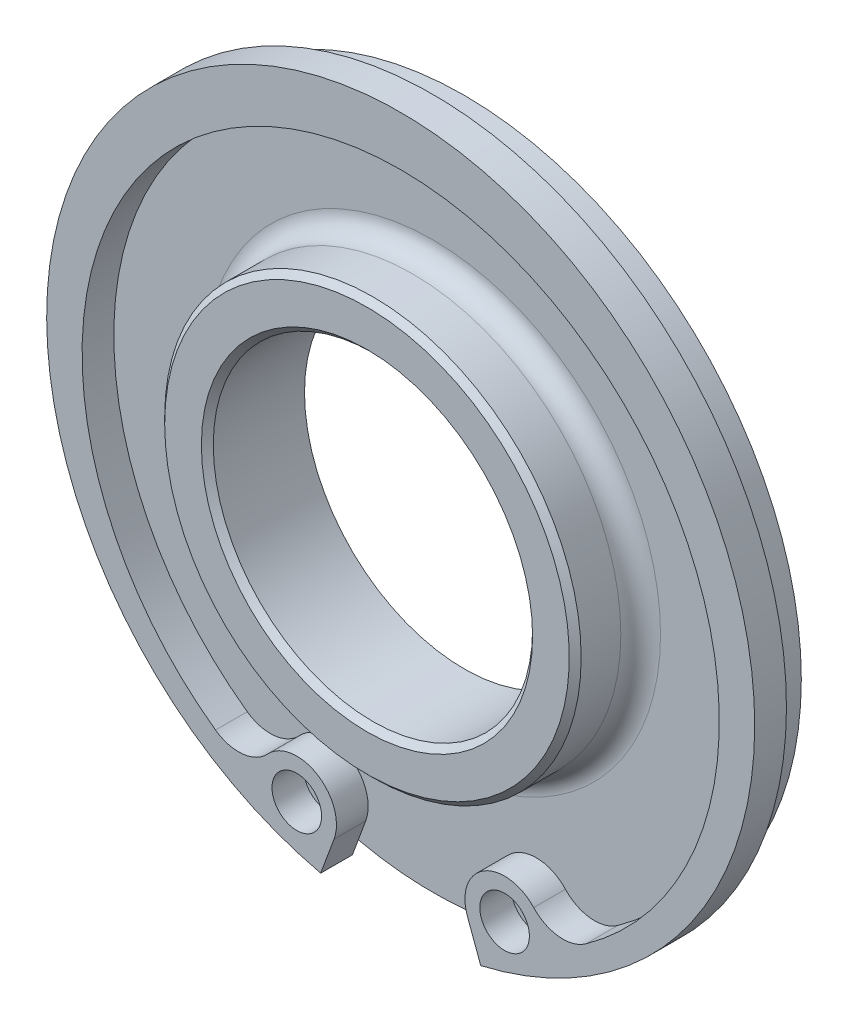
ISO-10303-21;
HEADER;
FILE_DESCRIPTION(('STEP AP214'),'2;1');
FILE_NAME('part.step','',(''),(''),'','','');
FILE_SCHEMA(('AUTOMOTIVE_DESIGN { 1 0 10303 214 1 1 1 1 }'));
ENDSEC;
DATA;
#1=APPLICATION_CONTEXT('core data for automotive mechanical design processes');
#2=APPLICATION_PROTOCOL_DEFINITION('international standard','automotive_design',2000,#1);
#3=PRODUCT_CONTEXT('',#1,'mechanical');
#4=PRODUCT('Part','Part','',(#3));
#5=PRODUCT_RELATED_PRODUCT_CATEGORY('part','',(#4));
#6=PRODUCT_DEFINITION_FORMATION('','',#4);
#7=PRODUCT_DEFINITION_CONTEXT('part definition',#1,'design');
#8=PRODUCT_DEFINITION('design','',#6,#7);
#9=PRODUCT_DEFINITION_SHAPE('','',#8);
#10=(LENGTH_UNIT() NAMED_UNIT(*) SI_UNIT(.MILLI.,.METRE.));
#11=(NAMED_UNIT(*) PLANE_ANGLE_UNIT() SI_UNIT($,.RADIAN.));
#12=(NAMED_UNIT(*) SI_UNIT($,.STERADIAN.) SOLID_ANGLE_UNIT());
#13=UNCERTAINTY_MEASURE_WITH_UNIT(LENGTH_MEASURE(1.E-05),#10,'distance_accuracy_value','');
#14=(GEOMETRIC_REPRESENTATION_CONTEXT(3) GLOBAL_UNCERTAINTY_ASSIGNED_CONTEXT((#13)) GLOBAL_UNIT_ASSIGNED_CONTEXT((#10,
#11,#12)) REPRESENTATION_CONTEXT('',''));
#15=CARTESIAN_POINT('',(0.,0.,0.));
#16=DIRECTION('',(0.,0.,1.));
#17=DIRECTION('',(1.,0.,0.));
#18=AXIS2_PLACEMENT_3D('',#15,#16,#17);
#19=CARTESIAN_POINT('',(0.,0.,3.));
#20=DIRECTION('',(0.,0.,-1.));
#21=DIRECTION('',(-1.,0.,0.));
#22=AXIS2_PLACEMENT_3D('',#19,#20,#21);
#23=CONICAL_SURFACE('',#22,10.5,0.785398163397453);
#24=CARTESIAN_POINT('',(0.,0.,3.));
#25=DIRECTION('',(0.,0.,-1.));
#26=DIRECTION('',(-1.,0.,0.));
#27=AXIS2_PLACEMENT_3D('',#24,#25,#26);
#28=CIRCLE('',#27,10.5);
#29=CARTESIAN_POINT('',(-10.5,0.,3.));
#30=VERTEX_POINT('',#29);
#31=EDGE_CURVE('E128',#30,#30,#28,.T.);
#32=ORIENTED_EDGE('',*,*,#31,.F.);
#33=EDGE_LOOP('',(#32));
#34=FACE_BOUND('',#33,.T.);
#35=CARTESIAN_POINT('',(0.,0.,3.3));
#36=DIRECTION('',(0.,0.,-1.));
#37=DIRECTION('',(-1.,0.,0.));
#38=AXIS2_PLACEMENT_3D('',#35,#36,#37);
#39=CIRCLE('',#38,10.2);
#40=CARTESIAN_POINT('',(-10.2,0.,3.29999999999999));
#41=VERTEX_POINT('',#40);
#42=EDGE_CURVE('E126',#41,#41,#39,.F.);
#43=ORIENTED_EDGE('',*,*,#42,.F.);
#44=EDGE_LOOP('',(#43));
#45=FACE_BOUND('',#44,.T.);
#46=ADVANCED_FACE('F18',(#34,#45),#23,.T.);
#47=CARTESIAN_POINT('',(0.,0.,3.3));
#48=DIRECTION('',(0.,0.,-1.));
#49=DIRECTION('',(-1.,0.,0.));
#50=AXIS2_PLACEMENT_3D('',#47,#48,#49);
#51=CYLINDRICAL_SURFACE('',#50,10.5);
#52=CARTESIAN_POINT('',(0.,0.,1.));
#53=DIRECTION('',(0.,0.,-1.));
#54=DIRECTION('',(-1.,0.,0.));
#55=AXIS2_PLACEMENT_3D('',#52,#53,#54);
#56=CIRCLE('',#55,10.5);
#57=CARTESIAN_POINT('',(-10.5,0.,0.999999999999998));
#58=VERTEX_POINT('',#57);
#59=EDGE_CURVE('E108',#58,#58,#56,.F.);
#60=ORIENTED_EDGE('',*,*,#59,.T.);
#61=EDGE_LOOP('',(#60));
#62=FACE_BOUND('',#61,.T.);
#63=ORIENTED_EDGE('',*,*,#31,.T.);
#64=EDGE_LOOP('',(#63));
#65=FACE_BOUND('',#64,.T.);
#66=ADVANCED_FACE('F459',(#62,#65),#51,.T.);
#67=CARTESIAN_POINT('',(0.,0.,1.6));
#68=DIRECTION('',(0.,0.,1.));
#69=DIRECTION('',(1.,0.,0.));
#70=AXIS2_PLACEMENT_3D('',#67,#68,#69);
#71=PLANE('',#70);
#72=CARTESIAN_POINT('',(-5.23872833875618,-14.8761229126396,1.6));
#73=DIRECTION('',(0.,0.,1.));
#74=DIRECTION('',(1.,0.,0.));
#75=AXIS2_PLACEMENT_3D('',#72,#73,#74);
#76=CIRCLE('',#75,1.25);
#77=CARTESIAN_POINT('',(-3.98872833875618,-14.8761229126396,1.6));
#78=VERTEX_POINT('',#77);
#79=EDGE_CURVE('E232',#78,#78,#76,.F.);
#80=ORIENTED_EDGE('',*,*,#79,.T.);
#81=EDGE_LOOP('',(#80));
#82=FACE_BOUND('',#81,.T.);
#83=CARTESIAN_POINT('',(8.17467961831291,-12.1594723859673,1.59999999999999));
#84=DIRECTION('',(0.,0.,1.));
#85=DIRECTION('',(1.,0.,0.));
#86=AXIS2_PLACEMENT_3D('',#83,#84,#85);
#87=CIRCLE('',#86,2.);
#88=CARTESIAN_POINT('',(9.33709406812633,-13.7869835677614,1.6));
#89=VERTEX_POINT('',#88);
#90=CARTESIAN_POINT('',(6.70670397853455,-13.5177976493035,1.59999999999999));
#91=VERTEX_POINT('',#90);
#92=EDGE_CURVE('E299',#89,#91,#87,.F.);
#93=ORIENTED_EDGE('',*,*,#92,.T.);
#94=CARTESIAN_POINT('',(5.23872833875618,-14.8761229126396,1.59999999999999));
#95=DIRECTION('',(0.,0.,1.));
#96=DIRECTION('',(1.,0.,0.));
#97=AXIS2_PLACEMENT_3D('',#94,#95,#96);
#98=CIRCLE('',#97,2.);
#99=CARTESIAN_POINT('',(3.36295046953239,-15.5699942157862,1.59999999999999));
#100=VERTEX_POINT('',#99);
#101=EDGE_CURVE('E296',#100,#91,#98,.F.);
#102=ORIENTED_EDGE('',*,*,#101,.F.);
#103=DIRECTION('',(-0.346935651573256,0.937888934611898,0.));
#104=VECTOR('',#103,1.);
#105=CARTESIAN_POINT('',(3.36295046953239,-15.5699942157862,1.59999999999999));
#106=LINE('',#105,#104);
#107=CARTESIAN_POINT('',(4.03540312491781,-17.3878699563634,1.6));
#108=VERTEX_POINT('',#107);
#109=EDGE_CURVE('E234',#100,#108,#106,.F.);
#110=ORIENTED_EDGE('',*,*,#109,.T.);
#111=CARTESIAN_POINT('',(0.,0.,1.59999999999999));
#112=DIRECTION('',(0.,0.,-1.));
#113=DIRECTION('',(-1.,0.,0.));
#114=AXIS2_PLACEMENT_3D('',#111,#112,#113);
#115=CIRCLE('',#114,17.85);
#116=CARTESIAN_POINT('',(-4.0354031249178,-17.3878699563634,1.6));
#117=VERTEX_POINT('',#116);
#118=EDGE_CURVE('E294',#117,#108,#115,.T.);
#119=ORIENTED_EDGE('',*,*,#118,.F.);
#120=DIRECTION('',(-0.346935651573256,-0.937888934611898,0.));
#121=VECTOR('',#120,1.);
#122=CARTESIAN_POINT('',(-3.36295046953239,-15.5699942157862,1.6));
#123=LINE('',#122,#121);
#124=CARTESIAN_POINT('',(-3.36295046953239,-15.5699942157862,1.6));
#125=VERTEX_POINT('',#124);
#126=EDGE_CURVE('E103',#117,#125,#123,.F.);
#127=ORIENTED_EDGE('',*,*,#126,.T.);
#128=CARTESIAN_POINT('',(-5.23872833875618,-14.8761229126396,1.6));
#129=DIRECTION('',(0.,0.,1.));
#130=DIRECTION('',(1.,0.,0.));
#131=AXIS2_PLACEMENT_3D('',#128,#129,#130);
#132=CIRCLE('',#131,2.);
#133=CARTESIAN_POINT('',(-6.70670397853455,-13.5177976493035,1.6));
#134=VERTEX_POINT('',#133);
#135=EDGE_CURVE('E95',#134,#125,#132,.F.);
#136=ORIENTED_EDGE('',*,*,#135,.F.);
#137=CARTESIAN_POINT('',(-8.17467961831291,-12.1594723859673,1.6));
#138=DIRECTION('',(0.,0.,1.));
#139=DIRECTION('',(1.,0.,0.));
#140=AXIS2_PLACEMENT_3D('',#137,#138,#139);
#141=CIRCLE('',#140,2.);
#142=CARTESIAN_POINT('',(-9.33709406812633,-13.7869835677614,1.6));
#143=VERTEX_POINT('',#142);
#144=EDGE_CURVE('E100',#134,#143,#141,.F.);
#145=ORIENTED_EDGE('',*,*,#144,.T.);
#146=CARTESIAN_POINT('',(0.,-0.713999999999992,1.6));
#147=DIRECTION('',(0.,0.,1.));
#148=DIRECTION('',(1.,0.,0.));
#149=AXIS2_PLACEMENT_3D('',#146,#147,#148);
#150=CIRCLE('',#149,16.065);
#151=EDGE_CURVE('E121',#143,#89,#150,.F.);
#152=ORIENTED_EDGE('',*,*,#151,.T.);
#153=EDGE_LOOP('',(#93,#102,#110,#119,#127,#136,#145,#152));
#154=FACE_BOUND('',#153,.T.);
#155=CARTESIAN_POINT('',(5.23872833875618,-14.8761229126396,1.59999999999999));
#156=DIRECTION('',(0.,0.,1.));
#157=DIRECTION('',(1.,0.,0.));
#158=AXIS2_PLACEMENT_3D('',#155,#156,#157);
#159=CIRCLE('',#158,1.25);
#160=CARTESIAN_POINT('',(6.48872833875618,-14.8761229126396,1.59999999999999));
#161=VERTEX_POINT('',#160);
#162=EDGE_CURVE('E289',#161,#161,#159,.F.);
#163=ORIENTED_EDGE('',*,*,#162,.T.);
#164=EDGE_LOOP('',(#163));
#165=FACE_BOUND('',#164,.T.);
#166=ADVANCED_FACE('F97',(#82,#154,#165),#71,.T.);
#167=CARTESIAN_POINT('',(0.,0.,3.3));
#168=DIRECTION('',(0.,0.,1.));
#169=DIRECTION('',(1.,0.,0.));
#170=AXIS2_PLACEMENT_3D('',#167,#168,#169);
#171=PLANE('',#170);
#172=ORIENTED_EDGE('',*,*,#42,.T.);
#173=EDGE_LOOP('',(#172));
#174=FACE_BOUND('',#173,.T.);
#175=CARTESIAN_POINT('',(0.,0.,3.3));
#176=DIRECTION('',(0.,0.,1.));
#177=DIRECTION('',(1.,0.,0.));
#178=AXIS2_PLACEMENT_3D('',#175,#176,#177);
#179=CIRCLE('',#178,8.35);
#180=CARTESIAN_POINT('',(8.35,0.,3.3));
#181=VERTEX_POINT('',#180);
#182=EDGE_CURVE('E286',#181,#181,#179,.F.);
#183=ORIENTED_EDGE('',*,*,#182,.T.);
#184=EDGE_LOOP('',(#183));
#185=FACE_BOUND('',#184,.T.);
#186=ADVANCED_FACE('F216',(#174,#185),#171,.T.);
#187=CARTESIAN_POINT('',(0.,0.,1.));
#188=DIRECTION('',(0.,0.,-1.));
#189=DIRECTION('',(-1.,0.,0.));
#190=AXIS2_PLACEMENT_3D('',#187,#188,#189);
#191=TOROIDAL_SURFACE('',#190,11.5,1.);
#192=CARTESIAN_POINT('',(0.,0.,0.));
#193=DIRECTION('',(0.,0.,1.));
#194=DIRECTION('',(1.,0.,0.));
#195=AXIS2_PLACEMENT_3D('',#192,#193,#194);
#196=CIRCLE('',#195,11.5);
#197=CARTESIAN_POINT('',(11.5,0.,0.));
#198=VERTEX_POINT('',#197);
#199=CARTESIAN_POINT('',(-11.5,0.,0.));
#200=VERTEX_POINT('',#199);
#201=EDGE_CURVE('E137',#198,#200,#196,.T.);
#202=ORIENTED_EDGE('',*,*,#201,.T.);
#203=CARTESIAN_POINT('',(0.,0.,0.));
#204=DIRECTION('',(0.,0.,1.));
#205=DIRECTION('',(-1.,0.,0.));
#206=AXIS2_PLACEMENT_3D('',#203,#204,#205);
#207=CIRCLE('',#206,11.5);
#208=EDGE_CURVE('E133',#200,#198,#207,.T.);
#209=ORIENTED_EDGE('',*,*,#208,.T.);
#210=EDGE_LOOP('',(#202,#209));
#211=FACE_BOUND('',#210,.T.);
#212=ORIENTED_EDGE('',*,*,#59,.F.);
#213=EDGE_LOOP('',(#212));
#214=FACE_BOUND('',#213,.T.);
#215=ADVANCED_FACE('F135',(#211,#214),#191,.F.);
#216=CARTESIAN_POINT('',(-5.23872833875618,-14.8761229126396,0.));
#217=DIRECTION('',(0.,0.,1.));
#218=DIRECTION('',(1.,0.,0.));
#219=AXIS2_PLACEMENT_3D('',#216,#217,#218);
#220=CYLINDRICAL_SURFACE('',#219,2.);
#221=DIRECTION('',(0.,0.,1.));
#222=VECTOR('',#221,1.);
#223=CARTESIAN_POINT('',(-6.70670397853455,-13.5177976493035,0.));
#224=LINE('',#223,#222);
#225=CARTESIAN_POINT('',(-6.70670397853455,-13.5177976493035,0.));
#226=VERTEX_POINT('',#225);
#227=EDGE_CURVE('E107',#226,#134,#224,.T.);
#228=ORIENTED_EDGE('',*,*,#227,.T.);
#229=ORIENTED_EDGE('',*,*,#135,.T.);
#230=DIRECTION('',(0.,0.,1.));
#231=VECTOR('',#230,1.);
#232=CARTESIAN_POINT('',(-3.36295046953239,-15.5699942157862,0.));
#233=LINE('',#232,#231);
#234=CARTESIAN_POINT('',(-3.36295046953239,-15.5699942157862,0.));
#235=VERTEX_POINT('',#234);
#236=EDGE_CURVE('E222',#125,#235,#233,.F.);
#237=ORIENTED_EDGE('',*,*,#236,.T.);
#238=CARTESIAN_POINT('',(-5.23872833875618,-14.8761229126396,0.));
#239=DIRECTION('',(0.,0.,1.));
#240=DIRECTION('',(1.,0.,0.));
#241=AXIS2_PLACEMENT_3D('',#238,#239,#240);
#242=CIRCLE('',#241,2.);
#243=EDGE_CURVE('E112',#235,#226,#242,.T.);
#244=ORIENTED_EDGE('',*,*,#243,.T.);
#245=EDGE_LOOP('',(#228,#229,#237,#244));
#246=FACE_BOUND('',#245,.T.);
#247=ADVANCED_FACE('F111',(#246),#220,.T.);
#248=CARTESIAN_POINT('',(-8.17467961831291,-12.1594723859673,0.));
#249=DIRECTION('',(0.,0.,1.));
#250=DIRECTION('',(1.,0.,0.));
#251=AXIS2_PLACEMENT_3D('',#248,#249,#250);
#252=CYLINDRICAL_SURFACE('',#251,2.);
#253=ORIENTED_EDGE('',*,*,#227,.F.);
#254=CARTESIAN_POINT('',(-8.17467961831291,-12.1594723859673,0.));
#255=DIRECTION('',(0.,0.,1.));
#256=DIRECTION('',(1.,0.,0.));
#257=AXIS2_PLACEMENT_3D('',#254,#255,#256);
#258=CIRCLE('',#257,2.);
#259=CARTESIAN_POINT('',(-9.33709406812633,-13.7869835677614,0.));
#260=VERTEX_POINT('',#259);
#261=EDGE_CURVE('E281',#226,#260,#258,.F.);
#262=ORIENTED_EDGE('',*,*,#261,.T.);
#263=DIRECTION('',(0.,0.,1.));
#264=VECTOR('',#263,1.);
#265=CARTESIAN_POINT('',(-9.33709406812633,-13.7869835677614,0.));
#266=LINE('',#265,#264);
#267=EDGE_CURVE('E119',#260,#143,#266,.T.);
#268=ORIENTED_EDGE('',*,*,#267,.T.);
#269=ORIENTED_EDGE('',*,*,#144,.F.);
#270=EDGE_LOOP('',(#253,#262,#268,#269));
#271=FACE_BOUND('',#270,.T.);
#272=ADVANCED_FACE('F117',(#271),#252,.F.);
#273=CARTESIAN_POINT('',(0.,-0.713999999999992,0.));
#274=DIRECTION('',(0.,0.,1.));
#275=DIRECTION('',(1.,0.,0.));
#276=AXIS2_PLACEMENT_3D('',#273,#274,#275);
#277=CYLINDRICAL_SURFACE('',#276,16.065);
#278=CARTESIAN_POINT('',(0.,-0.713999999999992,0.));
#279=DIRECTION('',(0.,0.,1.));
#280=DIRECTION('',(1.,0.,0.));
#281=AXIS2_PLACEMENT_3D('',#278,#279,#280);
#282=CIRCLE('',#281,16.065);
#283=CARTESIAN_POINT('',(9.33709406812633,-13.7869835677614,0.));
#284=VERTEX_POINT('',#283);
#285=EDGE_CURVE('E279',#260,#284,#282,.F.);
#286=ORIENTED_EDGE('',*,*,#285,.T.);
#287=DIRECTION('',(0.,0.,1.));
#288=VECTOR('',#287,1.);
#289=CARTESIAN_POINT('',(9.33709406812634,-13.7869835677614,0.));
#290=LINE('',#289,#288);
#291=EDGE_CURVE('E300',#284,#89,#290,.T.);
#292=ORIENTED_EDGE('',*,*,#291,.T.);
#293=ORIENTED_EDGE('',*,*,#151,.F.);
#294=ORIENTED_EDGE('',*,*,#267,.F.);
#295=EDGE_LOOP('',(#286,#292,#293,#294));
#296=FACE_BOUND('',#295,.T.);
#297=ADVANCED_FACE('F204',(#296),#277,.F.);
#298=CARTESIAN_POINT('',(8.17467961831291,-12.1594723859673,0.));
#299=DIRECTION('',(0.,0.,1.));
#300=DIRECTION('',(1.,0.,0.));
#301=AXIS2_PLACEMENT_3D('',#298,#299,#300);
#302=CYLINDRICAL_SURFACE('',#301,2.);
#303=ORIENTED_EDGE('',*,*,#291,.F.);
#304=CARTESIAN_POINT('',(8.17467961831291,-12.1594723859673,0.));
#305=DIRECTION('',(0.,0.,1.));
#306=DIRECTION('',(1.,0.,0.));
#307=AXIS2_PLACEMENT_3D('',#304,#305,#306);
#308=CIRCLE('',#307,2.);
#309=CARTESIAN_POINT('',(6.70670397853455,-13.5177976493035,0.));
#310=VERTEX_POINT('',#309);
#311=EDGE_CURVE('E277',#284,#310,#308,.F.);
#312=ORIENTED_EDGE('',*,*,#311,.T.);
#313=DIRECTION('',(0.,0.,1.));
#314=VECTOR('',#313,1.);
#315=CARTESIAN_POINT('',(6.70670397853455,-13.5177976493035,0.));
#316=LINE('',#315,#314);
#317=EDGE_CURVE('E298',#91,#310,#316,.F.);
#318=ORIENTED_EDGE('',*,*,#317,.F.);
#319=ORIENTED_EDGE('',*,*,#92,.F.);
#320=EDGE_LOOP('',(#303,#312,#318,#319));
#321=FACE_BOUND('',#320,.T.);
#322=ADVANCED_FACE('F200',(#321),#302,.F.);
#323=CARTESIAN_POINT('',(5.23872833875618,-14.8761229126396,0.));
#324=DIRECTION('',(0.,0.,1.));
#325=DIRECTION('',(1.,0.,0.));
#326=AXIS2_PLACEMENT_3D('',#323,#324,#325);
#327=CYLINDRICAL_SURFACE('',#326,2.);
#328=CARTESIAN_POINT('',(5.23872833875618,-14.8761229126396,0.));
#329=DIRECTION('',(0.,0.,1.));
#330=DIRECTION('',(1.,0.,0.));
#331=AXIS2_PLACEMENT_3D('',#328,#329,#330);
#332=CIRCLE('',#331,2.);
#333=CARTESIAN_POINT('',(3.36295046953239,-15.5699942157862,0.));
#334=VERTEX_POINT('',#333);
#335=EDGE_CURVE('E275',#310,#334,#332,.T.);
#336=ORIENTED_EDGE('',*,*,#335,.T.);
#337=DIRECTION('',(0.,0.,1.));
#338=VECTOR('',#337,1.);
#339=CARTESIAN_POINT('',(3.36295046953239,-15.5699942157862,0.));
#340=LINE('',#339,#338);
#341=EDGE_CURVE('E238',#334,#100,#340,.T.);
#342=ORIENTED_EDGE('',*,*,#341,.T.);
#343=ORIENTED_EDGE('',*,*,#101,.T.);
#344=ORIENTED_EDGE('',*,*,#317,.T.);
#345=EDGE_LOOP('',(#336,#342,#343,#344));
#346=FACE_BOUND('',#345,.T.);
#347=ADVANCED_FACE('F196',(#346),#327,.T.);
#348=CARTESIAN_POINT('',(3.36295046953239,-15.5699942157862,0.));
#349=DIRECTION('',(0.937888934611898,0.346935651573256,0.));
#350=DIRECTION('',(-0.346935651573256,0.937888934611898,0.));
#351=AXIS2_PLACEMENT_3D('',#348,#349,#350);
#352=PLANE('',#351);
#353=ORIENTED_EDGE('',*,*,#341,.F.);
#354=DIRECTION('',(0.346935651573264,-0.937888934611895,0.));
#355=VECTOR('',#354,1.);
#356=CARTESIAN_POINT('',(3.36295046953239,-15.5699942157862,0.));
#357=LINE('',#356,#355);
#358=CARTESIAN_POINT('',(3.73802181990547,-16.5839438275071,0.));
#359=VERTEX_POINT('',#358);
#360=EDGE_CURVE('E154',#334,#359,#357,.T.);
#361=ORIENTED_EDGE('',*,*,#360,.T.);
#362=DIRECTION('',(0.346935651573257,-0.937888934611897,0.));
#363=VECTOR('',#362,1.);
#364=CARTESIAN_POINT('',(3.73802181990547,-16.5839438275071,0.));
#365=LINE('',#364,#363);
#366=CARTESIAN_POINT('',(4.03540312491781,-17.3878699563634,0.));
#367=VERTEX_POINT('',#366);
#368=EDGE_CURVE('E273',#359,#367,#365,.T.);
#369=ORIENTED_EDGE('',*,*,#368,.T.);
#370=DIRECTION('',(0.,0.,-1.));
#371=VECTOR('',#370,1.);
#372=CARTESIAN_POINT('',(4.03540312491781,-17.3878699563634,1.6));
#373=LINE('',#372,#371);
#374=EDGE_CURVE('E237',#108,#367,#373,.T.);
#375=ORIENTED_EDGE('',*,*,#374,.F.);
#376=ORIENTED_EDGE('',*,*,#109,.F.);
#377=EDGE_LOOP('',(#353,#361,#369,#375,#376));
#378=FACE_BOUND('',#377,.T.);
#379=ADVANCED_FACE('F192',(#378),#352,.F.);
#380=CARTESIAN_POINT('',(0.,0.,1.6));
#381=DIRECTION('',(0.,0.,-1.));
#382=DIRECTION('',(-1.,0.,0.));
#383=AXIS2_PLACEMENT_3D('',#380,#381,#382);
#384=CYLINDRICAL_SURFACE('',#383,17.85);
#385=CARTESIAN_POINT('',(0.,0.,0.));
#386=DIRECTION('',(0.,0.,-1.));
#387=DIRECTION('',(-1.,0.,0.));
#388=AXIS2_PLACEMENT_3D('',#385,#386,#387);
#389=CIRCLE('',#388,17.85);
#390=CARTESIAN_POINT('',(-4.0354031249178,-17.3878699563634,0.));
#391=VERTEX_POINT('',#390);
#392=EDGE_CURVE('E270',#367,#391,#389,.F.);
#393=ORIENTED_EDGE('',*,*,#392,.T.);
#394=DIRECTION('',(0.,0.,1.));
#395=VECTOR('',#394,1.);
#396=CARTESIAN_POINT('',(-4.0354031249178,-17.3878699563634,0.));
#397=LINE('',#396,#395);
#398=EDGE_CURVE('E233',#391,#117,#397,.T.);
#399=ORIENTED_EDGE('',*,*,#398,.T.);
#400=ORIENTED_EDGE('',*,*,#118,.T.);
#401=ORIENTED_EDGE('',*,*,#374,.T.);
#402=EDGE_LOOP('',(#393,#399,#400,#401));
#403=FACE_BOUND('',#402,.T.);
#404=ADVANCED_FACE('F188',(#403),#384,.T.);
#405=CARTESIAN_POINT('',(-3.36295046953239,-15.5699942157862,0.));
#406=DIRECTION('',(-0.937888934611898,0.346935651573256,0.));
#407=DIRECTION('',(-0.346935651573256,-0.937888934611898,0.));
#408=AXIS2_PLACEMENT_3D('',#405,#406,#407);
#409=PLANE('',#408);
#410=ORIENTED_EDGE('',*,*,#398,.F.);
#411=DIRECTION('',(0.346935651573247,0.937888934611901,0.));
#412=VECTOR('',#411,1.);
#413=CARTESIAN_POINT('',(-4.0354031249178,-17.3878699563634,0.));
#414=LINE('',#413,#412);
#415=CARTESIAN_POINT('',(-3.73802181990547,-16.5839438275071,0.));
#416=VERTEX_POINT('',#415);
#417=EDGE_CURVE('E269',#391,#416,#414,.T.);
#418=ORIENTED_EDGE('',*,*,#417,.T.);
#419=DIRECTION('',(0.346935651573266,0.937888934611894,0.));
#420=VECTOR('',#419,1.);
#421=CARTESIAN_POINT('',(-3.73802181990547,-16.5839438275071,0.));
#422=LINE('',#421,#420);
#423=EDGE_CURVE('E145',#416,#235,#422,.T.);
#424=ORIENTED_EDGE('',*,*,#423,.T.);
#425=ORIENTED_EDGE('',*,*,#236,.F.);
#426=ORIENTED_EDGE('',*,*,#126,.F.);
#427=EDGE_LOOP('',(#410,#418,#424,#425,#426));
#428=FACE_BOUND('',#427,.T.);
#429=ADVANCED_FACE('F184',(#428),#409,.F.);
#430=CARTESIAN_POINT('',(-5.23872833875618,-14.8761229126396,0.));
#431=DIRECTION('',(0.,0.,1.));
#432=DIRECTION('',(1.,0.,0.));
#433=AXIS2_PLACEMENT_3D('',#430,#431,#432);
#434=CYLINDRICAL_SURFACE('',#433,1.25);
#435=ORIENTED_EDGE('',*,*,#79,.F.);
#436=EDGE_LOOP('',(#435));
#437=FACE_BOUND('',#436,.T.);
#438=CARTESIAN_POINT('',(-5.23872833875618,-14.8761229126396,0.));
#439=DIRECTION('',(0.,0.,1.));
#440=DIRECTION('',(1.,0.,0.));
#441=AXIS2_PLACEMENT_3D('',#438,#439,#440);
#442=CIRCLE('',#441,1.25);
#443=CARTESIAN_POINT('',(-5.41963302925929,-16.1129630368893,0.));
#444=VERTEX_POINT('',#443);
#445=CARTESIAN_POINT('',(-5.8727535642208,-15.9533935441314,0.));
#446=VERTEX_POINT('',#445);
#447=EDGE_CURVE('E266',#444,#446,#442,.F.);
#448=ORIENTED_EDGE('',*,*,#447,.T.);
#449=CARTESIAN_POINT('',(-5.23872833875618,-14.8761229126396,0.));
#450=DIRECTION('',(0.,0.,1.));
#451=DIRECTION('',(1.,0.,0.));
#452=AXIS2_PLACEMENT_3D('',#449,#450,#451);
#453=CIRCLE('',#452,1.25);
#454=EDGE_CURVE('E37',#446,#444,#453,.F.);
#455=ORIENTED_EDGE('',*,*,#454,.T.);
#456=EDGE_LOOP('',(#448,#455));
#457=FACE_BOUND('',#456,.T.);
#458=ADVANCED_FACE('F180',(#437,#457),#434,.F.);
#459=CARTESIAN_POINT('',(5.23872833875618,-14.8761229126396,0.));
#460=DIRECTION('',(0.,0.,1.));
#461=DIRECTION('',(1.,0.,0.));
#462=AXIS2_PLACEMENT_3D('',#459,#460,#461);
#463=CYLINDRICAL_SURFACE('',#462,1.25);
#464=ORIENTED_EDGE('',*,*,#162,.F.);
#465=EDGE_LOOP('',(#464));
#466=FACE_BOUND('',#465,.T.);
#467=CARTESIAN_POINT('',(5.23872833875618,-14.8761229126396,0.));
#468=DIRECTION('',(0.,0.,1.));
#469=DIRECTION('',(1.,0.,0.));
#470=AXIS2_PLACEMENT_3D('',#467,#468,#469);
#471=CIRCLE('',#470,1.25);
#472=CARTESIAN_POINT('',(5.8727535642208,-15.9533935441314,0.));
#473=VERTEX_POINT('',#472);
#474=CARTESIAN_POINT('',(5.41963302925928,-16.1129630368893,0.));
#475=VERTEX_POINT('',#474);
#476=EDGE_CURVE('E263',#473,#475,#471,.F.);
#477=ORIENTED_EDGE('',*,*,#476,.T.);
#478=CARTESIAN_POINT('',(5.23872833875618,-14.8761229126396,0.));
#479=DIRECTION('',(0.,0.,1.));
#480=DIRECTION('',(1.,0.,0.));
#481=AXIS2_PLACEMENT_3D('',#478,#479,#480);
#482=CIRCLE('',#481,1.25);
#483=EDGE_CURVE('E142',#475,#473,#482,.F.);
#484=ORIENTED_EDGE('',*,*,#483,.T.);
#485=EDGE_LOOP('',(#477,#484));
#486=FACE_BOUND('',#485,.T.);
#487=ADVANCED_FACE('F176',(#466,#486),#463,.F.);
#488=CARTESIAN_POINT('',(0.,0.,3.3));
#489=DIRECTION('',(0.,0.,1.));
#490=DIRECTION('',(1.,0.,0.));
#491=AXIS2_PLACEMENT_3D('',#488,#489,#490);
#492=CONICAL_SURFACE('',#491,8.35,0.785398163397447);
#493=ORIENTED_EDGE('',*,*,#182,.F.);
#494=EDGE_LOOP('',(#493));
#495=FACE_BOUND('',#494,.T.);
#496=CARTESIAN_POINT('',(0.,0.,3.));
#497=DIRECTION('',(0.,0.,-1.));
#498=DIRECTION('',(-1.,0.,0.));
#499=AXIS2_PLACEMENT_3D('',#496,#497,#498);
#500=CIRCLE('',#499,8.05);
#501=CARTESIAN_POINT('',(-8.05,0.,3.));
#502=VERTEX_POINT('',#501);
#503=EDGE_CURVE('E262',#502,#502,#500,.T.);
#504=ORIENTED_EDGE('',*,*,#503,.T.);
#505=EDGE_LOOP('',(#504));
#506=FACE_BOUND('',#505,.T.);
#507=ADVANCED_FACE('F172',(#495,#506),#492,.F.);
#508=CARTESIAN_POINT('',(0.,0.,0.));
#509=DIRECTION('',(0.,0.,-1.));
#510=DIRECTION('',(-1.,0.,0.));
#511=AXIS2_PLACEMENT_3D('',#508,#509,#510);
#512=PLANE('',#511);
#513=ORIENTED_EDGE('',*,*,#483,.F.);
#514=CARTESIAN_POINT('',(0.,0.,0.));
#515=DIRECTION('',(0.,0.,1.));
#516=DIRECTION('',(1.,0.,0.));
#517=AXIS2_PLACEMENT_3D('',#514,#515,#516);
#518=CIRCLE('',#517,17.);
#519=EDGE_CURVE('E259',#473,#475,#518,.F.);
#520=ORIENTED_EDGE('',*,*,#519,.F.);
#521=EDGE_LOOP('',(#513,#520));
#522=FACE_BOUND('',#521,.T.);
#523=ADVANCED_FACE('F166',(#522),#512,.F.);
#524=CARTESIAN_POINT('',(0.,0.,0.));
#525=DIRECTION('',(0.,0.,-1.));
#526=DIRECTION('',(-1.,0.,0.));
#527=AXIS2_PLACEMENT_3D('',#524,#525,#526);
#528=PLANE('',#527);
#529=ORIENTED_EDGE('',*,*,#360,.F.);
#530=ORIENTED_EDGE('',*,*,#335,.F.);
#531=ORIENTED_EDGE('',*,*,#311,.F.);
#532=ORIENTED_EDGE('',*,*,#285,.F.);
#533=ORIENTED_EDGE('',*,*,#261,.F.);
#534=ORIENTED_EDGE('',*,*,#243,.F.);
#535=ORIENTED_EDGE('',*,*,#423,.F.);
#536=CARTESIAN_POINT('',(0.,0.,0.));
#537=DIRECTION('',(0.,0.,1.));
#538=DIRECTION('',(1.,0.,0.));
#539=AXIS2_PLACEMENT_3D('',#536,#537,#538);
#540=CIRCLE('',#539,17.);
#541=EDGE_CURVE('E253',#359,#416,#540,.F.);
#542=ORIENTED_EDGE('',*,*,#541,.F.);
#543=EDGE_LOOP('',(#529,#530,#531,#532,#533,#534,#535,#542));
#544=FACE_BOUND('',#543,.T.);
#545=ORIENTED_EDGE('',*,*,#208,.F.);
#546=ORIENTED_EDGE('',*,*,#201,.F.);
#547=EDGE_LOOP('',(#545,#546));
#548=FACE_BOUND('',#547,.T.);
#549=ADVANCED_FACE('F144',(#544,#548),#528,.F.);
#550=CARTESIAN_POINT('',(0.,0.,0.));
#551=DIRECTION('',(0.,0.,-1.));
#552=DIRECTION('',(-1.,0.,0.));
#553=AXIS2_PLACEMENT_3D('',#550,#551,#552);
#554=PLANE('',#553);
#555=ORIENTED_EDGE('',*,*,#454,.F.);
#556=CARTESIAN_POINT('',(0.,0.,0.));
#557=DIRECTION('',(0.,0.,1.));
#558=DIRECTION('',(1.,0.,0.));
#559=AXIS2_PLACEMENT_3D('',#556,#557,#558);
#560=CIRCLE('',#559,17.);
#561=EDGE_CURVE('E247',#444,#446,#560,.F.);
#562=ORIENTED_EDGE('',*,*,#561,.F.);
#563=EDGE_LOOP('',(#555,#562));
#564=FACE_BOUND('',#563,.T.);
#565=ADVANCED_FACE('F165',(#564),#554,.F.);
#566=CARTESIAN_POINT('',(0.,0.,0.));
#567=DIRECTION('',(0.,0.,1.));
#568=DIRECTION('',(1.,0.,0.));
#569=AXIS2_PLACEMENT_3D('',#566,#567,#568);
#570=PLANE('',#569);
#571=ORIENTED_EDGE('',*,*,#476,.F.);
#572=CARTESIAN_POINT('',(0.,0.,0.));
#573=DIRECTION('',(0.,0.,1.));
#574=DIRECTION('',(1.,0.,0.));
#575=AXIS2_PLACEMENT_3D('',#572,#573,#574);
#576=CIRCLE('',#575,17.);
#577=EDGE_CURVE('E245',#446,#473,#576,.F.);
#578=ORIENTED_EDGE('',*,*,#577,.F.);
#579=ORIENTED_EDGE('',*,*,#447,.F.);
#580=CARTESIAN_POINT('',(0.,0.,0.));
#581=DIRECTION('',(0.,0.,1.));
#582=DIRECTION('',(1.,0.,0.));
#583=AXIS2_PLACEMENT_3D('',#580,#581,#582);
#584=CIRCLE('',#583,17.);
#585=EDGE_CURVE('E250',#416,#444,#584,.F.);
#586=ORIENTED_EDGE('',*,*,#585,.F.);
#587=ORIENTED_EDGE('',*,*,#417,.F.);
#588=ORIENTED_EDGE('',*,*,#392,.F.);
#589=ORIENTED_EDGE('',*,*,#368,.F.);
#590=CARTESIAN_POINT('',(0.,0.,0.));
#591=DIRECTION('',(0.,0.,1.));
#592=DIRECTION('',(1.,0.,0.));
#593=AXIS2_PLACEMENT_3D('',#590,#591,#592);
#594=CIRCLE('',#593,17.);
#595=EDGE_CURVE('E256',#475,#359,#594,.F.);
#596=ORIENTED_EDGE('',*,*,#595,.F.);
#597=EDGE_LOOP('',(#571,#578,#579,#586,#587,#588,#589,#596));
#598=FACE_BOUND('',#597,.T.);
#599=ADVANCED_FACE('F328',(#598),#570,.F.);
#600=CARTESIAN_POINT('',(0.,0.,3.3));
#601=DIRECTION('',(0.,0.,-1.));
#602=DIRECTION('',(-1.,0.,0.));
#603=AXIS2_PLACEMENT_3D('',#600,#601,#602);
#604=CYLINDRICAL_SURFACE('',#603,8.05);
#605=CARTESIAN_POINT('',(0.,0.,-1.60000000000001));
#606=DIRECTION('',(0.,0.,-1.));
#607=DIRECTION('',(-1.,0.,0.));
#608=AXIS2_PLACEMENT_3D('',#605,#606,#607);
#609=CIRCLE('',#608,8.05);
#610=CARTESIAN_POINT('',(-8.05,0.,-1.60000000000001));
#611=VERTEX_POINT('',#610);
#612=EDGE_CURVE('E29',#611,#611,#609,.F.);
#613=ORIENTED_EDGE('',*,*,#612,.F.);
#614=EDGE_LOOP('',(#613));
#615=FACE_BOUND('',#614,.T.);
#616=ORIENTED_EDGE('',*,*,#503,.F.);
#617=EDGE_LOOP('',(#616));
#618=FACE_BOUND('',#617,.T.);
#619=ADVANCED_FACE('F355',(#615,#618),#604,.F.);
#620=CARTESIAN_POINT('',(0.,0.,-1.60000000000001));
#621=DIRECTION('',(0.,0.,1.));
#622=DIRECTION('',(1.,0.,0.));
#623=AXIS2_PLACEMENT_3D('',#620,#621,#622);
#624=CYLINDRICAL_SURFACE('',#623,17.);
#625=ORIENTED_EDGE('',*,*,#561,.T.);
#626=ORIENTED_EDGE('',*,*,#577,.T.);
#627=ORIENTED_EDGE('',*,*,#519,.T.);
#628=ORIENTED_EDGE('',*,*,#595,.T.);
#629=ORIENTED_EDGE('',*,*,#541,.T.);
#630=ORIENTED_EDGE('',*,*,#585,.T.);
#631=EDGE_LOOP('',(#625,#626,#627,#628,#629,#630));
#632=FACE_BOUND('',#631,.T.);
#633=CARTESIAN_POINT('',(0.,0.,-1.60000000000001));
#634=DIRECTION('',(0.,0.,1.));
#635=DIRECTION('',(1.,0.,0.));
#636=AXIS2_PLACEMENT_3D('',#633,#634,#635);
#637=CIRCLE('',#636,17.);
#638=CARTESIAN_POINT('',(17.,0.,-1.60000000000001));
#639=VERTEX_POINT('',#638);
#640=EDGE_CURVE('E11',#639,#639,#637,.F.);
#641=ORIENTED_EDGE('',*,*,#640,.F.);
#642=EDGE_LOOP('',(#641));
#643=FACE_BOUND('',#642,.T.);
#644=ADVANCED_FACE('F331',(#632,#643),#624,.T.);
#645=CARTESIAN_POINT('',(0.,0.,-1.60000000000001));
#646=DIRECTION('',(0.,0.,-1.));
#647=DIRECTION('',(-1.,0.,0.));
#648=AXIS2_PLACEMENT_3D('',#645,#646,#647);
#649=PLANE('',#648);
#650=ORIENTED_EDGE('',*,*,#640,.T.);
#651=EDGE_LOOP('',(#650));
#652=FACE_BOUND('',#651,.T.);
#653=ORIENTED_EDGE('',*,*,#612,.T.);
#654=EDGE_LOOP('',(#653));
#655=FACE_BOUND('',#654,.T.);
#656=ADVANCED_FACE('F356',(#652,#655),#649,.T.);
#657=CLOSED_SHELL('',(#46,#66,#166,#186,#215,#247,#272,#297,#322,#347,#379,#404,#429,#458,#487,
#507,#523,#549,#565,#599,#619,#644,#656));
#658=MANIFOLD_SOLID_BREP('B1',#657);
#659=ADVANCED_BREP_SHAPE_REPRESENTATION('',(#18,#658),#14);
#660=SHAPE_DEFINITION_REPRESENTATION(#9,#659);
ENDSEC;
END-ISO-10303-21;
